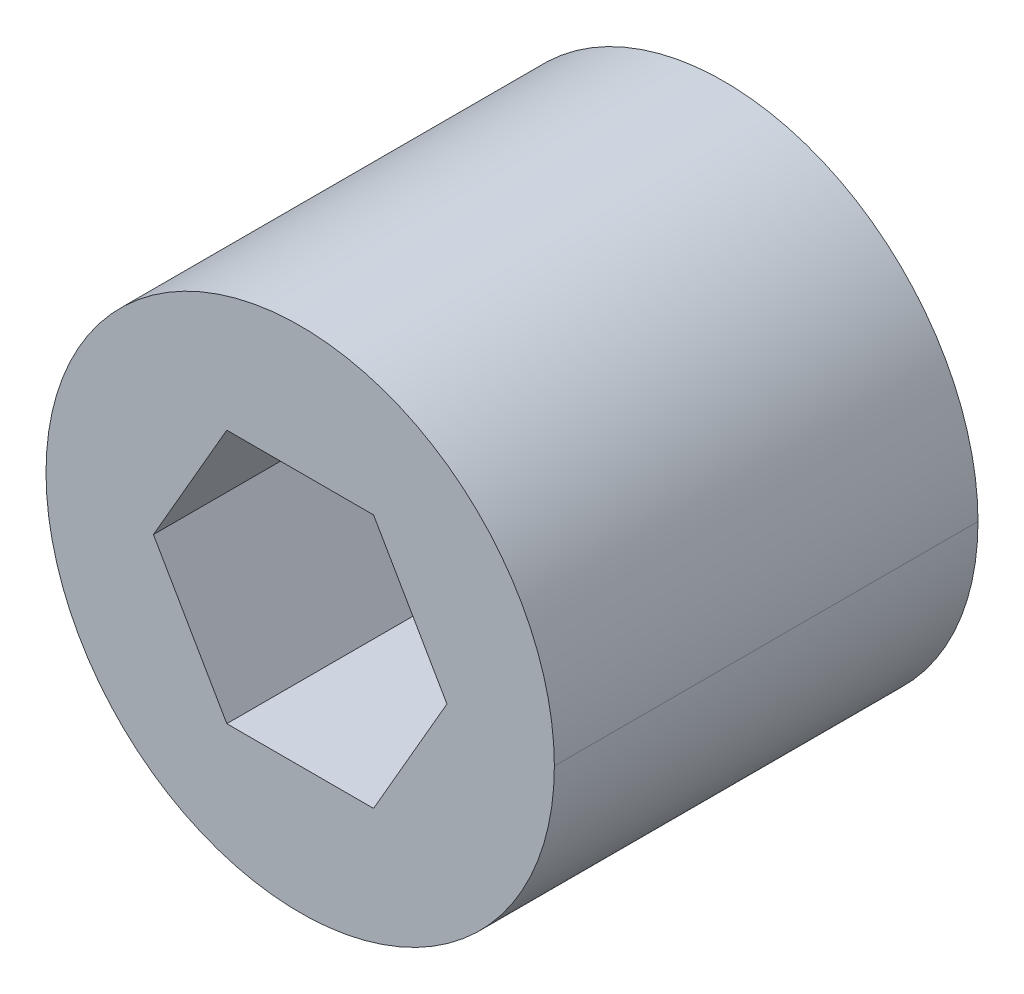
ISO-10303-21;
HEADER;
FILE_DESCRIPTION(('STEP AP214'),'2;1');
FILE_NAME('part.step','',(''),(''),'','','');
FILE_SCHEMA(('AUTOMOTIVE_DESIGN { 1 0 10303 214 1 1 1 1 }'));
ENDSEC;
DATA;
#1=APPLICATION_CONTEXT('core data for automotive mechanical design processes');
#2=APPLICATION_PROTOCOL_DEFINITION('international standard','automotive_design',2000,#1);
#3=PRODUCT_CONTEXT('',#1,'mechanical');
#4=PRODUCT('Part','Part','',(#3));
#5=PRODUCT_RELATED_PRODUCT_CATEGORY('part','',(#4));
#6=PRODUCT_DEFINITION_FORMATION('','',#4);
#7=PRODUCT_DEFINITION_CONTEXT('part definition',#1,'design');
#8=PRODUCT_DEFINITION('design','',#6,#7);
#9=PRODUCT_DEFINITION_SHAPE('','',#8);
#10=(LENGTH_UNIT() NAMED_UNIT(*) SI_UNIT(.MILLI.,.METRE.));
#11=(NAMED_UNIT(*) PLANE_ANGLE_UNIT() SI_UNIT($,.RADIAN.));
#12=(NAMED_UNIT(*) SI_UNIT($,.STERADIAN.) SOLID_ANGLE_UNIT());
#13=UNCERTAINTY_MEASURE_WITH_UNIT(LENGTH_MEASURE(1.E-05),#10,'distance_accuracy_value','');
#14=(GEOMETRIC_REPRESENTATION_CONTEXT(3) GLOBAL_UNCERTAINTY_ASSIGNED_CONTEXT((#13)) GLOBAL_UNIT_ASSIGNED_CONTEXT((#10,
#11,#12)) REPRESENTATION_CONTEXT('',''));
#15=CARTESIAN_POINT('',(0.,0.,0.));
#16=DIRECTION('',(0.,0.,1.));
#17=DIRECTION('',(1.,0.,0.));
#18=AXIS2_PLACEMENT_3D('',#15,#16,#17);
#19=CARTESIAN_POINT('',(0.,0.,-1.5));
#20=DIRECTION('',(0.,0.,1.));
#21=DIRECTION('',(1.,0.,0.));
#22=AXIS2_PLACEMENT_3D('',#19,#20,#21);
#23=PLANE('',#22);
#24=DIRECTION('',(1.,0.,0.));
#25=VECTOR('',#24,1.);
#26=CARTESIAN_POINT('',(-0.433012701892219,-0.75,-1.5));
#27=LINE('',#26,#25);
#28=CARTESIAN_POINT('',(-0.433012701892219,-0.75,-1.5));
#29=VERTEX_POINT('',#28);
#30=CARTESIAN_POINT('',(0.43301270189222,-0.75,-1.5));
#31=VERTEX_POINT('',#30);
#32=EDGE_CURVE('E151',#29,#31,#27,.T.);
#33=ORIENTED_EDGE('',*,*,#32,.T.);
#34=DIRECTION('',(0.5,0.866025403784439,0.));
#35=VECTOR('',#34,1.);
#36=CARTESIAN_POINT('',(0.43301270189222,-0.75,-1.5));
#37=LINE('',#36,#35);
#38=CARTESIAN_POINT('',(0.866025403784439,0.,-1.5));
#39=VERTEX_POINT('',#38);
#40=EDGE_CURVE('E11',#31,#39,#37,.T.);
#41=ORIENTED_EDGE('',*,*,#40,.T.);
#42=DIRECTION('',(-0.5,0.866025403784439,0.));
#43=VECTOR('',#42,1.);
#44=CARTESIAN_POINT('',(0.866025403784439,0.,-1.5));
#45=LINE('',#44,#43);
#46=CARTESIAN_POINT('',(0.43301270189222,0.75,-1.5));
#47=VERTEX_POINT('',#46);
#48=EDGE_CURVE('E46',#39,#47,#45,.T.);
#49=ORIENTED_EDGE('',*,*,#48,.T.);
#50=DIRECTION('',(-1.,0.,0.));
#51=VECTOR('',#50,1.);
#52=CARTESIAN_POINT('',(0.43301270189222,0.75,-1.5));
#53=LINE('',#52,#51);
#54=CARTESIAN_POINT('',(-0.433012701892219,0.75,-1.5));
#55=VERTEX_POINT('',#54);
#56=EDGE_CURVE('E206',#47,#55,#53,.T.);
#57=ORIENTED_EDGE('',*,*,#56,.T.);
#58=DIRECTION('',(-0.5,-0.866025403784439,0.));
#59=VECTOR('',#58,1.);
#60=CARTESIAN_POINT('',(-0.433012701892219,0.75,-1.5));
#61=LINE('',#60,#59);
#62=CARTESIAN_POINT('',(-0.866025403784438,0.,-1.5));
#63=VERTEX_POINT('',#62);
#64=EDGE_CURVE('E200',#55,#63,#61,.T.);
#65=ORIENTED_EDGE('',*,*,#64,.T.);
#66=DIRECTION('',(0.5,-0.866025403784439,0.));
#67=VECTOR('',#66,1.);
#68=CARTESIAN_POINT('',(-0.866025403784438,0.,-1.5));
#69=LINE('',#68,#67);
#70=EDGE_CURVE('E167',#63,#29,#69,.T.);
#71=ORIENTED_EDGE('',*,*,#70,.T.);
#72=EDGE_LOOP('',(#33,#41,#49,#57,#65,#71));
#73=FACE_BOUND('',#72,.T.);
#74=ADVANCED_FACE('F18',(#73),#23,.T.);
#75=CARTESIAN_POINT('',(0.43301270189222,-0.75,-1.5));
#76=DIRECTION('',(0.866025403784439,-0.5,0.));
#77=DIRECTION('',(0.,0.,-1.));
#78=AXIS2_PLACEMENT_3D('',#75,#76,#77);
#79=PLANE('',#78);
#80=DIRECTION('',(0.5,0.866025403784439,0.));
#81=VECTOR('',#80,1.);
#82=CARTESIAN_POINT('',(0.43301270189222,-0.75,0.));
#83=LINE('',#82,#81);
#84=CARTESIAN_POINT('',(0.43301270189222,-0.75,0.));
#85=VERTEX_POINT('',#84);
#86=CARTESIAN_POINT('',(0.866025403784439,0.,0.));
#87=VERTEX_POINT('',#86);
#88=EDGE_CURVE('E152',#85,#87,#83,.T.);
#89=ORIENTED_EDGE('',*,*,#88,.T.);
#90=DIRECTION('',(0.,0.,1.));
#91=VECTOR('',#90,1.);
#92=CARTESIAN_POINT('',(0.866025403784439,0.,-1.5));
#93=LINE('',#92,#91);
#94=EDGE_CURVE('E27',#39,#87,#93,.T.);
#95=ORIENTED_EDGE('',*,*,#94,.F.);
#96=ORIENTED_EDGE('',*,*,#40,.F.);
#97=DIRECTION('',(0.,0.,1.));
#98=VECTOR('',#97,1.);
#99=CARTESIAN_POINT('',(0.43301270189222,-0.75,-1.5));
#100=LINE('',#99,#98);
#101=EDGE_CURVE('E148',#31,#85,#100,.T.);
#102=ORIENTED_EDGE('',*,*,#101,.T.);
#103=EDGE_LOOP('',(#89,#95,#96,#102));
#104=FACE_BOUND('',#103,.T.);
#105=ADVANCED_FACE('F20',(#104),#79,.F.);
#106=CARTESIAN_POINT('',(0.866025403784439,0.,-1.5));
#107=DIRECTION('',(0.866025403784439,0.5,0.));
#108=DIRECTION('',(0.,0.,-1.));
#109=AXIS2_PLACEMENT_3D('',#106,#107,#108);
#110=PLANE('',#109);
#111=DIRECTION('',(-0.5,0.866025403784439,0.));
#112=VECTOR('',#111,1.);
#113=CARTESIAN_POINT('',(0.866025403784439,0.,0.));
#114=LINE('',#113,#112);
#115=CARTESIAN_POINT('',(0.43301270189222,0.75,0.));
#116=VERTEX_POINT('',#115);
#117=EDGE_CURVE('E187',#87,#116,#114,.T.);
#118=ORIENTED_EDGE('',*,*,#117,.T.);
#119=DIRECTION('',(0.,0.,1.));
#120=VECTOR('',#119,1.);
#121=CARTESIAN_POINT('',(0.43301270189222,0.75,-1.5));
#122=LINE('',#121,#120);
#123=EDGE_CURVE('E209',#47,#116,#122,.T.);
#124=ORIENTED_EDGE('',*,*,#123,.F.);
#125=ORIENTED_EDGE('',*,*,#48,.F.);
#126=ORIENTED_EDGE('',*,*,#94,.T.);
#127=EDGE_LOOP('',(#118,#124,#125,#126));
#128=FACE_BOUND('',#127,.T.);
#129=ADVANCED_FACE('F217',(#128),#110,.F.);
#130=CARTESIAN_POINT('',(0.43301270189222,0.75,-1.5));
#131=DIRECTION('',(0.,1.,0.));
#132=DIRECTION('',(1.,0.,0.));
#133=AXIS2_PLACEMENT_3D('',#130,#131,#132);
#134=PLANE('',#133);
#135=DIRECTION('',(-1.,0.,0.));
#136=VECTOR('',#135,1.);
#137=CARTESIAN_POINT('',(0.43301270189222,0.75,0.));
#138=LINE('',#137,#136);
#139=CARTESIAN_POINT('',(-0.433012701892219,0.75,0.));
#140=VERTEX_POINT('',#139);
#141=EDGE_CURVE('E183',#116,#140,#138,.T.);
#142=ORIENTED_EDGE('',*,*,#141,.T.);
#143=DIRECTION('',(0.,0.,1.));
#144=VECTOR('',#143,1.);
#145=CARTESIAN_POINT('',(-0.433012701892219,0.75,-1.5));
#146=LINE('',#145,#144);
#147=EDGE_CURVE('E203',#55,#140,#146,.T.);
#148=ORIENTED_EDGE('',*,*,#147,.F.);
#149=ORIENTED_EDGE('',*,*,#56,.F.);
#150=ORIENTED_EDGE('',*,*,#123,.T.);
#151=EDGE_LOOP('',(#142,#148,#149,#150));
#152=FACE_BOUND('',#151,.T.);
#153=ADVANCED_FACE('F231',(#152),#134,.F.);
#154=CARTESIAN_POINT('',(-0.433012701892219,0.75,-1.5));
#155=DIRECTION('',(-0.866025403784439,0.5,0.));
#156=DIRECTION('',(0.,0.,1.));
#157=AXIS2_PLACEMENT_3D('',#154,#155,#156);
#158=PLANE('',#157);
#159=DIRECTION('',(-0.5,-0.866025403784439,0.));
#160=VECTOR('',#159,1.);
#161=CARTESIAN_POINT('',(-0.433012701892219,0.75,0.));
#162=LINE('',#161,#160);
#163=CARTESIAN_POINT('',(-0.866025403784438,0.,0.));
#164=VERTEX_POINT('',#163);
#165=EDGE_CURVE('E175',#140,#164,#162,.T.);
#166=ORIENTED_EDGE('',*,*,#165,.T.);
#167=DIRECTION('',(0.,0.,1.));
#168=VECTOR('',#167,1.);
#169=CARTESIAN_POINT('',(-0.866025403784438,0.,-1.5));
#170=LINE('',#169,#168);
#171=EDGE_CURVE('E170',#63,#164,#170,.T.);
#172=ORIENTED_EDGE('',*,*,#171,.F.);
#173=ORIENTED_EDGE('',*,*,#64,.F.);
#174=ORIENTED_EDGE('',*,*,#147,.T.);
#175=EDGE_LOOP('',(#166,#172,#173,#174));
#176=FACE_BOUND('',#175,.T.);
#177=ADVANCED_FACE('F238',(#176),#158,.F.);
#178=CARTESIAN_POINT('',(-0.866025403784438,0.,-1.5));
#179=DIRECTION('',(-0.866025403784439,-0.5,0.));
#180=DIRECTION('',(-0.5,0.866025403784439,0.));
#181=AXIS2_PLACEMENT_3D('',#178,#179,#180);
#182=PLANE('',#181);
#183=DIRECTION('',(0.5,-0.866025403784439,0.));
#184=VECTOR('',#183,1.);
#185=CARTESIAN_POINT('',(-0.866025403784438,0.,0.));
#186=LINE('',#185,#184);
#187=CARTESIAN_POINT('',(-0.433012701892219,-0.75,0.));
#188=VERTEX_POINT('',#187);
#189=EDGE_CURVE('E163',#164,#188,#186,.T.);
#190=ORIENTED_EDGE('',*,*,#189,.T.);
#191=DIRECTION('',(0.,0.,1.));
#192=VECTOR('',#191,1.);
#193=CARTESIAN_POINT('',(-0.433012701892219,-0.75,-1.5));
#194=LINE('',#193,#192);
#195=EDGE_CURVE('E171',#29,#188,#194,.T.);
#196=ORIENTED_EDGE('',*,*,#195,.F.);
#197=ORIENTED_EDGE('',*,*,#70,.F.);
#198=ORIENTED_EDGE('',*,*,#171,.T.);
#199=EDGE_LOOP('',(#190,#196,#197,#198));
#200=FACE_BOUND('',#199,.T.);
#201=ADVANCED_FACE('F240',(#200),#182,.F.);
#202=CARTESIAN_POINT('',(-0.433012701892219,-0.75,-1.5));
#203=DIRECTION('',(0.,-1.,0.));
#204=DIRECTION('',(0.,0.,-1.));
#205=AXIS2_PLACEMENT_3D('',#202,#203,#204);
#206=PLANE('',#205);
#207=DIRECTION('',(1.,0.,0.));
#208=VECTOR('',#207,1.);
#209=CARTESIAN_POINT('',(-0.433012701892219,-0.75,0.));
#210=LINE('',#209,#208);
#211=EDGE_CURVE('E122',#188,#85,#210,.T.);
#212=ORIENTED_EDGE('',*,*,#211,.T.);
#213=ORIENTED_EDGE('',*,*,#101,.F.);
#214=ORIENTED_EDGE('',*,*,#32,.F.);
#215=ORIENTED_EDGE('',*,*,#195,.T.);
#216=EDGE_LOOP('',(#212,#213,#214,#215));
#217=FACE_BOUND('',#216,.T.);
#218=ADVANCED_FACE('F243',(#217),#206,.F.);
#219=CARTESIAN_POINT('',(0.,0.,-2.5));
#220=DIRECTION('',(0.,0.,1.));
#221=DIRECTION('',(1.,0.,0.));
#222=AXIS2_PLACEMENT_3D('',#219,#220,#221);
#223=CONICAL_SURFACE('',#222,1.5,1.0471975511966);
#224=DIRECTION('',(-0.866025403784438,0.,0.5));
#225=VECTOR('',#224,1.);
#226=CARTESIAN_POINT('',(-1.5,0.,-2.5));
#227=LINE('',#226,#225);
#228=CARTESIAN_POINT('',(-0.633974596215562,0.,-3.));
#229=VERTEX_POINT('',#228);
#230=CARTESIAN_POINT('',(-1.5,0.,-2.5));
#231=VERTEX_POINT('',#230);
#232=EDGE_CURVE('E126',#229,#231,#227,.T.);
#233=ORIENTED_EDGE('',*,*,#232,.F.);
#234=CARTESIAN_POINT('',(0.,0.,-3.));
#235=DIRECTION('',(0.,0.,-1.));
#236=DIRECTION('',(1.,0.,0.));
#237=AXIS2_PLACEMENT_3D('',#234,#235,#236);
#238=CIRCLE('',#237,0.633974596215562);
#239=CARTESIAN_POINT('',(0.633974596215562,0.,-3.));
#240=VERTEX_POINT('',#239);
#241=EDGE_CURVE('E113',#240,#229,#238,.T.);
#242=ORIENTED_EDGE('',*,*,#241,.F.);
#243=DIRECTION('',(0.866025403784438,0.,0.5));
#244=VECTOR('',#243,1.);
#245=CARTESIAN_POINT('',(1.5,0.,-2.5));
#246=LINE('',#245,#244);
#247=CARTESIAN_POINT('',(1.5,0.,-2.5));
#248=VERTEX_POINT('',#247);
#249=EDGE_CURVE('E136',#240,#248,#246,.T.);
#250=ORIENTED_EDGE('',*,*,#249,.T.);
#251=CARTESIAN_POINT('',(0.,0.,-2.5));
#252=DIRECTION('',(0.,0.,1.));
#253=DIRECTION('',(1.,0.,0.));
#254=AXIS2_PLACEMENT_3D('',#251,#252,#253);
#255=CIRCLE('',#254,1.5);
#256=EDGE_CURVE('E128',#231,#248,#255,.T.);
#257=ORIENTED_EDGE('',*,*,#256,.F.);
#258=EDGE_LOOP('',(#233,#242,#250,#257));
#259=FACE_BOUND('',#258,.T.);
#260=ADVANCED_FACE('F127',(#259),#223,.T.);
#261=CARTESIAN_POINT('',(0.,0.,0.));
#262=DIRECTION('',(0.,0.,1.));
#263=DIRECTION('',(1.,0.,0.));
#264=AXIS2_PLACEMENT_3D('',#261,#262,#263);
#265=PLANE('',#264);
#266=ORIENTED_EDGE('',*,*,#211,.F.);
#267=ORIENTED_EDGE('',*,*,#189,.F.);
#268=ORIENTED_EDGE('',*,*,#165,.F.);
#269=ORIENTED_EDGE('',*,*,#141,.F.);
#270=ORIENTED_EDGE('',*,*,#117,.F.);
#271=ORIENTED_EDGE('',*,*,#88,.F.);
#272=EDGE_LOOP('',(#266,#267,#268,#269,#270,#271));
#273=FACE_BOUND('',#272,.T.);
#274=CARTESIAN_POINT('',(0.,0.,0.));
#275=DIRECTION('',(0.,0.,1.));
#276=DIRECTION('',(1.,0.,0.));
#277=AXIS2_PLACEMENT_3D('',#274,#275,#276);
#278=CIRCLE('',#277,1.5);
#279=CARTESIAN_POINT('',(1.5,0.,0.));
#280=VERTEX_POINT('',#279);
#281=CARTESIAN_POINT('',(-1.5,0.,0.));
#282=VERTEX_POINT('',#281);
#283=EDGE_CURVE('E157',#280,#282,#278,.T.);
#284=ORIENTED_EDGE('',*,*,#283,.T.);
#285=CARTESIAN_POINT('',(0.,0.,0.));
#286=DIRECTION('',(0.,0.,1.));
#287=DIRECTION('',(1.,0.,0.));
#288=AXIS2_PLACEMENT_3D('',#285,#286,#287);
#289=CIRCLE('',#288,1.5);
#290=EDGE_CURVE('E123',#282,#280,#289,.T.);
#291=ORIENTED_EDGE('',*,*,#290,.T.);
#292=EDGE_LOOP('',(#284,#291));
#293=FACE_BOUND('',#292,.T.);
#294=ADVANCED_FACE('F225',(#273,#293),#265,.T.);
#295=CARTESIAN_POINT('',(0.,0.,-3.));
#296=DIRECTION('',(0.,0.,1.));
#297=DIRECTION('',(1.,0.,0.));
#298=AXIS2_PLACEMENT_3D('',#295,#296,#297);
#299=PLANE('',#298);
#300=ORIENTED_EDGE('',*,*,#241,.T.);
#301=CARTESIAN_POINT('',(0.,0.,-3.));
#302=DIRECTION('',(0.,0.,-1.));
#303=DIRECTION('',(1.,0.,0.));
#304=AXIS2_PLACEMENT_3D('',#301,#302,#303);
#305=CIRCLE('',#304,0.633974596215562);
#306=EDGE_CURVE('E117',#229,#240,#305,.T.);
#307=ORIENTED_EDGE('',*,*,#306,.T.);
#308=EDGE_LOOP('',(#300,#307));
#309=FACE_BOUND('',#308,.T.);
#310=ADVANCED_FACE('F115',(#309),#299,.F.);
#311=CARTESIAN_POINT('',(0.,0.,-3.));
#312=DIRECTION('',(0.,0.,1.));
#313=DIRECTION('',(1.,0.,0.));
#314=AXIS2_PLACEMENT_3D('',#311,#312,#313);
#315=CYLINDRICAL_SURFACE('',#314,1.5);
#316=DIRECTION('',(0.,0.,1.));
#317=VECTOR('',#316,1.);
#318=CARTESIAN_POINT('',(-1.5,0.,-3.));
#319=LINE('',#318,#317);
#320=EDGE_CURVE('E153',#231,#282,#319,.T.);
#321=ORIENTED_EDGE('',*,*,#320,.F.);
#322=ORIENTED_EDGE('',*,*,#256,.T.);
#323=DIRECTION('',(0.,0.,1.));
#324=VECTOR('',#323,1.);
#325=CARTESIAN_POINT('',(1.5,0.,-3.));
#326=LINE('',#325,#324);
#327=EDGE_CURVE('E143',#248,#280,#326,.T.);
#328=ORIENTED_EDGE('',*,*,#327,.T.);
#329=ORIENTED_EDGE('',*,*,#290,.F.);
#330=EDGE_LOOP('',(#321,#322,#328,#329));
#331=FACE_BOUND('',#330,.T.);
#332=ADVANCED_FACE('F266',(#331),#315,.T.);
#333=CARTESIAN_POINT('',(0.,0.,-3.));
#334=DIRECTION('',(0.,0.,1.));
#335=DIRECTION('',(1.,0.,0.));
#336=AXIS2_PLACEMENT_3D('',#333,#334,#335);
#337=CYLINDRICAL_SURFACE('',#336,1.5);
#338=CARTESIAN_POINT('',(0.,0.,-2.5));
#339=DIRECTION('',(0.,0.,1.));
#340=DIRECTION('',(1.,0.,0.));
#341=AXIS2_PLACEMENT_3D('',#338,#339,#340);
#342=CIRCLE('',#341,1.5);
#343=EDGE_CURVE('E133',#248,#231,#342,.T.);
#344=ORIENTED_EDGE('',*,*,#343,.T.);
#345=ORIENTED_EDGE('',*,*,#320,.T.);
#346=ORIENTED_EDGE('',*,*,#283,.F.);
#347=ORIENTED_EDGE('',*,*,#327,.F.);
#348=EDGE_LOOP('',(#344,#345,#346,#347));
#349=FACE_BOUND('',#348,.T.);
#350=ADVANCED_FACE('F263',(#349),#337,.T.);
#351=CARTESIAN_POINT('',(0.,0.,-2.5));
#352=DIRECTION('',(0.,0.,1.));
#353=DIRECTION('',(1.,0.,0.));
#354=AXIS2_PLACEMENT_3D('',#351,#352,#353);
#355=CONICAL_SURFACE('',#354,1.5,1.0471975511966);
#356=ORIENTED_EDGE('',*,*,#306,.F.);
#357=ORIENTED_EDGE('',*,*,#232,.T.);
#358=ORIENTED_EDGE('',*,*,#343,.F.);
#359=ORIENTED_EDGE('',*,*,#249,.F.);
#360=EDGE_LOOP('',(#356,#357,#358,#359));
#361=FACE_BOUND('',#360,.T.);
#362=ADVANCED_FACE('F135',(#361),#355,.T.);
#363=CLOSED_SHELL('',(#74,#105,#129,#153,#177,#201,#218,#260,#294,#310,#332,#350,#362));
#364=MANIFOLD_SOLID_BREP('B1',#363);
#365=ADVANCED_BREP_SHAPE_REPRESENTATION('',(#18,#364),#14);
#366=SHAPE_DEFINITION_REPRESENTATION(#9,#365);
ENDSEC;
END-ISO-10303-21;
